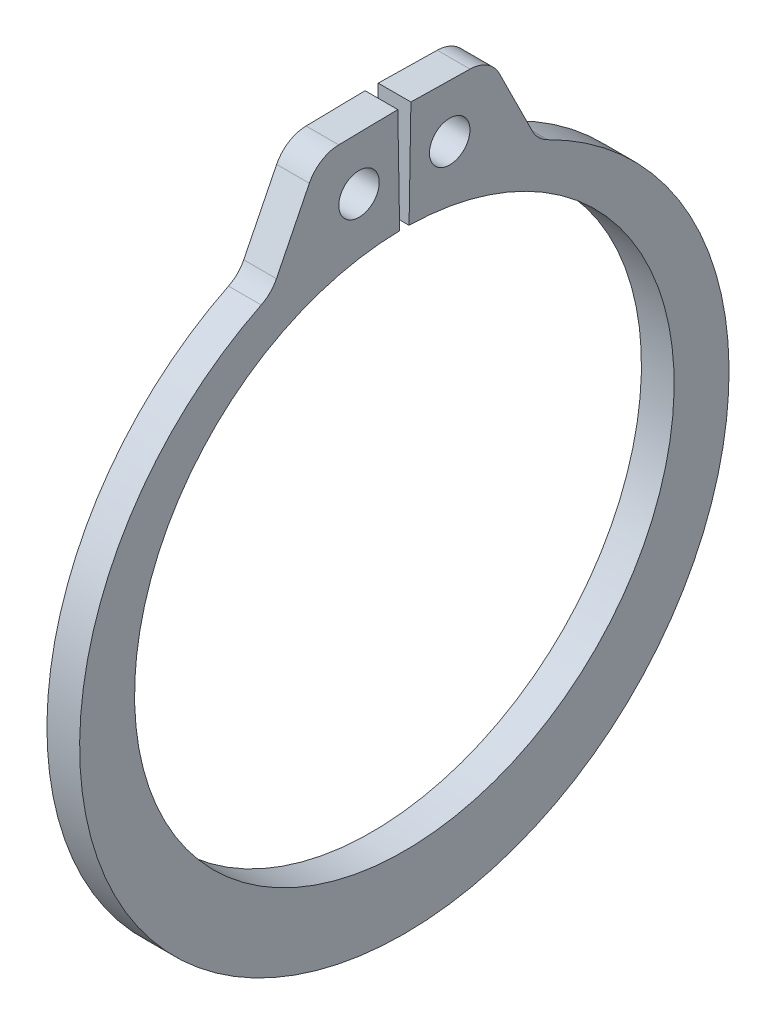
ISO-10303-21;
HEADER;
FILE_DESCRIPTION(('STEP AP214'),'2;1');
FILE_NAME('part.step','',(''),(''),'','','');
FILE_SCHEMA(('AUTOMOTIVE_DESIGN { 1 0 10303 214 1 1 1 1 }'));
ENDSEC;
DATA;
#1=APPLICATION_CONTEXT('core data for automotive mechanical design processes');
#2=APPLICATION_PROTOCOL_DEFINITION('international standard','automotive_design',2000,#1);
#3=PRODUCT_CONTEXT('',#1,'mechanical');
#4=PRODUCT('Part','Part','',(#3));
#5=PRODUCT_RELATED_PRODUCT_CATEGORY('part','',(#4));
#6=PRODUCT_DEFINITION_FORMATION('','',#4);
#7=PRODUCT_DEFINITION_CONTEXT('part definition',#1,'design');
#8=PRODUCT_DEFINITION('design','',#6,#7);
#9=PRODUCT_DEFINITION_SHAPE('','',#8);
#10=(LENGTH_UNIT() NAMED_UNIT(*) SI_UNIT(.MILLI.,.METRE.));
#11=(NAMED_UNIT(*) PLANE_ANGLE_UNIT() SI_UNIT($,.RADIAN.));
#12=(NAMED_UNIT(*) SI_UNIT($,.STERADIAN.) SOLID_ANGLE_UNIT());
#13=UNCERTAINTY_MEASURE_WITH_UNIT(LENGTH_MEASURE(1.E-05),#10,'distance_accuracy_value','');
#14=(GEOMETRIC_REPRESENTATION_CONTEXT(3) GLOBAL_UNCERTAINTY_ASSIGNED_CONTEXT((#13)) GLOBAL_UNIT_ASSIGNED_CONTEXT((#10,
#11,#12)) REPRESENTATION_CONTEXT('',''));
#15=CARTESIAN_POINT('',(0.,0.,0.));
#16=DIRECTION('',(0.,0.,1.));
#17=DIRECTION('',(1.,0.,0.));
#18=AXIS2_PLACEMENT_3D('',#15,#16,#17);
#19=CARTESIAN_POINT('',(0.533399999999989,0.,0.));
#20=DIRECTION('',(1.,0.,0.));
#21=DIRECTION('',(0.,0.,-1.));
#22=AXIS2_PLACEMENT_3D('',#19,#20,#21);
#23=PLANE('',#22);
#24=CARTESIAN_POINT('',(0.533399999999989,10.5040886416162,-1.47894687499924));
#25=DIRECTION('',(-1.,0.,0.));
#26=DIRECTION('',(0.,0.,1.));
#27=AXIS2_PLACEMENT_3D('',#24,#25,#26);
#28=CIRCLE('',#27,0.6604);
#29=CARTESIAN_POINT('',(0.533399999999989,10.5040886416162,-0.818546874999241));
#30=VERTEX_POINT('',#29);
#31=EDGE_CURVE('E109',#30,#30,#28,.T.);
#32=ORIENTED_EDGE('',*,*,#31,.T.);
#33=EDGE_LOOP('',(#32));
#34=FACE_BOUND('',#33,.T.);
#35=CARTESIAN_POINT('',(0.533399999999989,0.,0.));
#36=DIRECTION('',(-1.,0.,0.));
#37=DIRECTION('',(0.,0.,1.));
#38=AXIS2_PLACEMENT_3D('',#35,#36,#37);
#39=CIRCLE('',#38,8.8011);
#40=CARTESIAN_POINT('',(0.533399999999989,8.79975954984092,-0.153600374295177));
#41=VERTEX_POINT('',#40);
#42=CARTESIAN_POINT('',(0.533399999999989,8.79975954984092,0.153600374295175));
#43=VERTEX_POINT('',#42);
#44=EDGE_CURVE('E175',#41,#43,#39,.T.);
#45=ORIENTED_EDGE('',*,*,#44,.T.);
#46=DIRECTION('',(0.,-0.999847695156391,-0.0174524064372834));
#47=VECTOR('',#46,1.);
#48=CARTESIAN_POINT('',(0.533399999999989,8.79975954984091,0.153600374295175));
#49=LINE('',#48,#47);
#50=CARTESIAN_POINT('',(0.533399999999989,12.2536334279892,0.213887967092126));
#51=VERTEX_POINT('',#50);
#52=EDGE_CURVE('E125',#43,#51,#49,.F.);
#53=ORIENTED_EDGE('',*,*,#52,.T.);
#54=DIRECTION('',(0.,0.0174524064372834,-0.999847695156391));
#55=VECTOR('',#54,1.);
#56=CARTESIAN_POINT('',(0.533399999999989,12.2536334279892,0.213887967092126));
#57=LINE('',#56,#55);
#58=CARTESIAN_POINT('',(0.533399999999989,12.21999978275,2.14075821234738));
#59=VERTEX_POINT('',#58);
#60=EDGE_CURVE('E120',#51,#59,#57,.F.);
#61=ORIENTED_EDGE('',*,*,#60,.T.);
#62=CARTESIAN_POINT('',(0.533399999999989,11.1279661301002,2.12169669403658));
#63=DIRECTION('',(-1.,0.,0.));
#64=DIRECTION('',(0.,0.,1.));
#65=AXIS2_PLACEMENT_3D('',#62,#63,#64);
#66=CIRCLE('',#65,1.0922);
#67=CARTESIAN_POINT('',(0.533399999999989,11.6141614114107,3.09971253666458));
#68=VERTEX_POINT('',#67);
#69=EDGE_CURVE('E113',#68,#59,#66,.T.);
#70=ORIENTED_EDGE('',*,*,#69,.F.);
#71=DIRECTION('',(0.,0.895454900776411,-0.445152244378829));
#72=VECTOR('',#71,1.);
#73=CARTESIAN_POINT('',(0.533399999999989,12.2084177333914,2.80429337570331));
#74=LINE('',#73,#72);
#75=CARTESIAN_POINT('',(0.533399999999989,9.45539137797145,4.17288922557434));
#76=VERTEX_POINT('',#75);
#77=EDGE_CURVE('E108',#68,#76,#74,.F.);
#78=ORIENTED_EDGE('',*,*,#77,.T.);
#79=CARTESIAN_POINT('',(0.533399999999989,9.941586659282,5.15090506820234));
#80=DIRECTION('',(-1.,0.,0.));
#81=DIRECTION('',(0.,0.,1.));
#82=AXIS2_PLACEMENT_3D('',#79,#80,#81);
#83=CIRCLE('',#82,1.0922);
#84=CARTESIAN_POINT('',(0.533399999999989,8.96124610534802,4.66941442622431));
#85=VERTEX_POINT('',#84);
#86=EDGE_CURVE('E99',#76,#85,#83,.T.);
#87=ORIENTED_EDGE('',*,*,#86,.T.);
#88=CARTESIAN_POINT('',(0.533399999999989,-0.545929997486656,0.));
#89=DIRECTION('',(-1.,0.,0.));
#90=DIRECTION('',(0.,0.,1.));
#91=AXIS2_PLACEMENT_3D('',#88,#89,#90);
#92=CIRCLE('',#91,10.5919700025133);
#93=CARTESIAN_POINT('',(0.533399999999989,8.96124610534802,-4.66941442622431));
#94=VERTEX_POINT('',#93);
#95=EDGE_CURVE('E182',#94,#85,#92,.T.);
#96=ORIENTED_EDGE('',*,*,#95,.F.);
#97=CARTESIAN_POINT('',(0.533399999999989,9.941586659282,-5.15090506820234));
#98=DIRECTION('',(-1.,0.,0.));
#99=DIRECTION('',(0.,0.,1.));
#100=AXIS2_PLACEMENT_3D('',#97,#98,#99);
#101=CIRCLE('',#100,1.0922);
#102=CARTESIAN_POINT('',(0.533399999999989,9.45539137797145,-4.17288922557434));
#103=VERTEX_POINT('',#102);
#104=EDGE_CURVE('E179',#94,#103,#101,.T.);
#105=ORIENTED_EDGE('',*,*,#104,.T.);
#106=DIRECTION('',(0.,-0.895454900776411,-0.445152244378829));
#107=VECTOR('',#106,1.);
#108=CARTESIAN_POINT('',(0.533399999999989,12.2084177333914,-2.80429337570331));
#109=LINE('',#108,#107);
#110=CARTESIAN_POINT('',(0.533399999999989,11.6141614114107,-3.09971253666458));
#111=VERTEX_POINT('',#110);
#112=EDGE_CURVE('E144',#103,#111,#109,.F.);
#113=ORIENTED_EDGE('',*,*,#112,.T.);
#114=CARTESIAN_POINT('',(0.533399999999989,11.1279661301002,-2.12169669403658));
#115=DIRECTION('',(-1.,0.,0.));
#116=DIRECTION('',(0.,0.,1.));
#117=AXIS2_PLACEMENT_3D('',#114,#115,#116);
#118=CIRCLE('',#117,1.0922);
#119=CARTESIAN_POINT('',(0.533399999999989,12.21999978275,-2.14075821234738));
#120=VERTEX_POINT('',#119);
#121=EDGE_CURVE('E146',#120,#111,#118,.T.);
#122=ORIENTED_EDGE('',*,*,#121,.F.);
#123=DIRECTION('',(0.,-0.0174524064372835,-0.999847695156391));
#124=VECTOR('',#123,1.);
#125=CARTESIAN_POINT('',(0.533399999999989,12.2536334279892,-0.213887967092127));
#126=LINE('',#125,#124);
#127=CARTESIAN_POINT('',(0.533399999999989,12.2536334279892,-0.213887967092128));
#128=VERTEX_POINT('',#127);
#129=EDGE_CURVE('E138',#120,#128,#126,.F.);
#130=ORIENTED_EDGE('',*,*,#129,.T.);
#131=DIRECTION('',(0.,0.999847695156391,-0.0174524064372835));
#132=VECTOR('',#131,1.);
#133=CARTESIAN_POINT('',(0.533399999999989,8.79975954984091,-0.153600374295177));
#134=LINE('',#133,#132);
#135=EDGE_CURVE('E131',#128,#41,#134,.F.);
#136=ORIENTED_EDGE('',*,*,#135,.T.);
#137=EDGE_LOOP('',(#45,#53,#61,#70,#78,#87,#96,#105,#113,#122,#130,#136));
#138=FACE_BOUND('',#137,.T.);
#139=CARTESIAN_POINT('',(0.533399999999989,10.5040886416162,1.47894687499924));
#140=DIRECTION('',(-1.,0.,0.));
#141=DIRECTION('',(0.,0.,1.));
#142=AXIS2_PLACEMENT_3D('',#139,#140,#141);
#143=CIRCLE('',#142,0.6604);
#144=CARTESIAN_POINT('',(0.533399999999989,10.5040886416162,2.13934687499924));
#145=VERTEX_POINT('',#144);
#146=EDGE_CURVE('E21',#145,#145,#143,.T.);
#147=ORIENTED_EDGE('',*,*,#146,.T.);
#148=EDGE_LOOP('',(#147));
#149=FACE_BOUND('',#148,.T.);
#150=ADVANCED_FACE('F18',(#34,#138,#149),#23,.T.);
#151=CARTESIAN_POINT('',(0.533399999999989,10.5040886416162,1.47894687499924));
#152=DIRECTION('',(-1.,0.,0.));
#153=DIRECTION('',(0.,0.,1.));
#154=AXIS2_PLACEMENT_3D('',#151,#152,#153);
#155=CYLINDRICAL_SURFACE('',#154,0.6604);
#156=CARTESIAN_POINT('',(-0.533399999999989,10.5040886416162,1.47894687499924));
#157=DIRECTION('',(-1.,0.,0.));
#158=DIRECTION('',(0.,0.,1.));
#159=AXIS2_PLACEMENT_3D('',#156,#157,#158);
#160=CIRCLE('',#159,0.6604);
#161=CARTESIAN_POINT('',(-0.533399999999989,10.5040886416162,2.13934687499924));
#162=VERTEX_POINT('',#161);
#163=EDGE_CURVE('E169',#162,#162,#160,.T.);
#164=ORIENTED_EDGE('',*,*,#163,.T.);
#165=EDGE_LOOP('',(#164));
#166=FACE_BOUND('',#165,.T.);
#167=ORIENTED_EDGE('',*,*,#146,.F.);
#168=EDGE_LOOP('',(#167));
#169=FACE_BOUND('',#168,.T.);
#170=ADVANCED_FACE('F362',(#166,#169),#155,.F.);
#171=CARTESIAN_POINT('',(0.533399999999989,9.941586659282,5.15090506820234));
#172=DIRECTION('',(-1.,0.,0.));
#173=DIRECTION('',(0.,0.,1.));
#174=AXIS2_PLACEMENT_3D('',#171,#172,#173);
#175=CYLINDRICAL_SURFACE('',#174,1.0922);
#176=DIRECTION('',(1.,0.,0.));
#177=VECTOR('',#176,1.);
#178=CARTESIAN_POINT('',(0.533399999999989,9.45539137797145,4.17288922557434));
#179=LINE('',#178,#177);
#180=CARTESIAN_POINT('',(-0.533399999999989,9.45539137797145,4.17288922557434));
#181=VERTEX_POINT('',#180);
#182=EDGE_CURVE('E103',#76,#181,#179,.F.);
#183=ORIENTED_EDGE('',*,*,#182,.T.);
#184=CARTESIAN_POINT('',(-0.533399999999989,9.941586659282,5.15090506820234));
#185=DIRECTION('',(-1.,0.,0.));
#186=DIRECTION('',(0.,0.,1.));
#187=AXIS2_PLACEMENT_3D('',#184,#185,#186);
#188=CIRCLE('',#187,1.0922);
#189=CARTESIAN_POINT('',(-0.533399999999989,8.96124610534802,4.66941442622431));
#190=VERTEX_POINT('',#189);
#191=EDGE_CURVE('E167',#181,#190,#188,.T.);
#192=ORIENTED_EDGE('',*,*,#191,.T.);
#193=DIRECTION('',(-1.,0.,0.));
#194=VECTOR('',#193,1.);
#195=CARTESIAN_POINT('',(0.533399999999989,8.96124610534802,4.66941442622431));
#196=LINE('',#195,#194);
#197=EDGE_CURVE('E104',#85,#190,#196,.T.);
#198=ORIENTED_EDGE('',*,*,#197,.F.);
#199=ORIENTED_EDGE('',*,*,#86,.F.);
#200=EDGE_LOOP('',(#183,#192,#198,#199));
#201=FACE_BOUND('',#200,.T.);
#202=ADVANCED_FACE('F101',(#201),#175,.F.);
#203=CARTESIAN_POINT('',(0.533399999999989,-0.545929997486656,0.));
#204=DIRECTION('',(-1.,0.,0.));
#205=DIRECTION('',(0.,0.,1.));
#206=AXIS2_PLACEMENT_3D('',#203,#204,#205);
#207=CYLINDRICAL_SURFACE('',#206,10.5919700025133);
#208=CARTESIAN_POINT('',(-0.533399999999989,-0.545929997486656,0.));
#209=DIRECTION('',(-1.,0.,0.));
#210=DIRECTION('',(0.,0.,1.));
#211=AXIS2_PLACEMENT_3D('',#208,#209,#210);
#212=CIRCLE('',#211,10.5919700025133);
#213=CARTESIAN_POINT('',(-0.533399999999989,8.96124610534802,-4.66941442622431));
#214=VERTEX_POINT('',#213);
#215=EDGE_CURVE('E165',#190,#214,#212,.F.);
#216=ORIENTED_EDGE('',*,*,#215,.T.);
#217=DIRECTION('',(-1.,0.,0.));
#218=VECTOR('',#217,1.);
#219=CARTESIAN_POINT('',(0.533399999999989,8.96124610534802,-4.66941442622431));
#220=LINE('',#219,#218);
#221=EDGE_CURVE('E181',#214,#94,#220,.F.);
#222=ORIENTED_EDGE('',*,*,#221,.T.);
#223=ORIENTED_EDGE('',*,*,#95,.T.);
#224=ORIENTED_EDGE('',*,*,#197,.T.);
#225=EDGE_LOOP('',(#216,#222,#223,#224));
#226=FACE_BOUND('',#225,.T.);
#227=ADVANCED_FACE('F187',(#226),#207,.T.);
#228=CARTESIAN_POINT('',(0.533399999999989,9.941586659282,-5.15090506820234));
#229=DIRECTION('',(-1.,0.,0.));
#230=DIRECTION('',(0.,0.,1.));
#231=AXIS2_PLACEMENT_3D('',#228,#229,#230);
#232=CYLINDRICAL_SURFACE('',#231,1.0922);
#233=ORIENTED_EDGE('',*,*,#221,.F.);
#234=CARTESIAN_POINT('',(-0.533399999999989,9.941586659282,-5.15090506820234));
#235=DIRECTION('',(-1.,0.,0.));
#236=DIRECTION('',(0.,0.,1.));
#237=AXIS2_PLACEMENT_3D('',#234,#235,#236);
#238=CIRCLE('',#237,1.0922);
#239=CARTESIAN_POINT('',(-0.533399999999989,9.45539137797145,-4.17288922557434));
#240=VERTEX_POINT('',#239);
#241=EDGE_CURVE('E162',#214,#240,#238,.T.);
#242=ORIENTED_EDGE('',*,*,#241,.T.);
#243=DIRECTION('',(1.,0.,0.));
#244=VECTOR('',#243,1.);
#245=CARTESIAN_POINT('',(0.533399999999989,9.45539137797145,-4.17288922557434));
#246=LINE('',#245,#244);
#247=EDGE_CURVE('E147',#240,#103,#246,.T.);
#248=ORIENTED_EDGE('',*,*,#247,.T.);
#249=ORIENTED_EDGE('',*,*,#104,.F.);
#250=EDGE_LOOP('',(#233,#242,#248,#249));
#251=FACE_BOUND('',#250,.T.);
#252=ADVANCED_FACE('F199',(#251),#232,.F.);
#253=CARTESIAN_POINT('',(0.533399999999989,12.2084177333914,-2.80429337570331));
#254=DIRECTION('',(0.,-0.445152244378829,0.895454900776411));
#255=DIRECTION('',(0.,-0.895454900776411,-0.445152244378829));
#256=AXIS2_PLACEMENT_3D('',#253,#254,#255);
#257=PLANE('',#256);
#258=ORIENTED_EDGE('',*,*,#247,.F.);
#259=DIRECTION('',(0.,0.89545490077641,0.445152244378829));
#260=VECTOR('',#259,1.);
#261=CARTESIAN_POINT('',(-0.533399999999989,9.45539137797145,-4.17288922557434));
#262=LINE('',#261,#260);
#263=CARTESIAN_POINT('',(-0.533399999999989,11.6141614114107,-3.09971253666458));
#264=VERTEX_POINT('',#263);
#265=EDGE_CURVE('E161',#240,#264,#262,.T.);
#266=ORIENTED_EDGE('',*,*,#265,.T.);
#267=DIRECTION('',(-1.,0.,0.));
#268=VECTOR('',#267,1.);
#269=CARTESIAN_POINT('',(0.533399999999989,11.6141614114107,-3.09971253666458));
#270=LINE('',#269,#268);
#271=EDGE_CURVE('E178',#111,#264,#270,.T.);
#272=ORIENTED_EDGE('',*,*,#271,.F.);
#273=ORIENTED_EDGE('',*,*,#112,.F.);
#274=EDGE_LOOP('',(#258,#266,#272,#273));
#275=FACE_BOUND('',#274,.T.);
#276=ADVANCED_FACE('F204',(#275),#257,.F.);
#277=CARTESIAN_POINT('',(0.533399999999989,11.1279661301002,-2.12169669403658));
#278=DIRECTION('',(-1.,0.,0.));
#279=DIRECTION('',(0.,0.,1.));
#280=AXIS2_PLACEMENT_3D('',#277,#278,#279);
#281=CYLINDRICAL_SURFACE('',#280,1.0922);
#282=CARTESIAN_POINT('',(-0.533399999999989,11.1279661301002,-2.12169669403658));
#283=DIRECTION('',(-1.,0.,0.));
#284=DIRECTION('',(0.,0.,1.));
#285=AXIS2_PLACEMENT_3D('',#282,#283,#284);
#286=CIRCLE('',#285,1.0922);
#287=CARTESIAN_POINT('',(-0.533399999999989,12.21999978275,-2.14075821234738));
#288=VERTEX_POINT('',#287);
#289=EDGE_CURVE('E157',#264,#288,#286,.F.);
#290=ORIENTED_EDGE('',*,*,#289,.T.);
#291=DIRECTION('',(1.,0.,0.));
#292=VECTOR('',#291,1.);
#293=CARTESIAN_POINT('',(0.533399999999989,12.21999978275,-2.14075821234738));
#294=LINE('',#293,#292);
#295=EDGE_CURVE('E141',#288,#120,#294,.T.);
#296=ORIENTED_EDGE('',*,*,#295,.T.);
#297=ORIENTED_EDGE('',*,*,#121,.T.);
#298=ORIENTED_EDGE('',*,*,#271,.T.);
#299=EDGE_LOOP('',(#290,#296,#297,#298));
#300=FACE_BOUND('',#299,.T.);
#301=ADVANCED_FACE('F267',(#300),#281,.T.);
#302=CARTESIAN_POINT('',(0.533399999999989,12.2536334279892,-0.213887967092127));
#303=DIRECTION('',(0.,-0.999847695156391,0.0174524064372835));
#304=DIRECTION('',(0.,-0.0174524064372835,-0.999847695156391));
#305=AXIS2_PLACEMENT_3D('',#302,#303,#304);
#306=PLANE('',#305);
#307=ORIENTED_EDGE('',*,*,#295,.F.);
#308=DIRECTION('',(0.,0.0174524064372837,0.999847695156391));
#309=VECTOR('',#308,1.);
#310=CARTESIAN_POINT('',(-0.533399999999989,12.21999978275,-2.14075821234738));
#311=LINE('',#310,#309);
#312=CARTESIAN_POINT('',(-0.533399999999989,12.2536334279892,-0.213887967092128));
#313=VERTEX_POINT('',#312);
#314=EDGE_CURVE('E160',#288,#313,#311,.T.);
#315=ORIENTED_EDGE('',*,*,#314,.T.);
#316=DIRECTION('',(1.,0.,0.));
#317=VECTOR('',#316,1.);
#318=CARTESIAN_POINT('',(0.533399999999989,12.2536334279892,-0.213887967092129));
#319=LINE('',#318,#317);
#320=EDGE_CURVE('E135',#313,#128,#319,.T.);
#321=ORIENTED_EDGE('',*,*,#320,.T.);
#322=ORIENTED_EDGE('',*,*,#129,.F.);
#323=EDGE_LOOP('',(#307,#315,#321,#322));
#324=FACE_BOUND('',#323,.T.);
#325=ADVANCED_FACE('F265',(#324),#306,.F.);
#326=CARTESIAN_POINT('',(0.533399999999989,8.79975954984091,-0.153600374295177));
#327=DIRECTION('',(0.,-0.0174524064372835,-0.999847695156391));
#328=DIRECTION('',(0.,0.999847695156391,-0.0174524064372835));
#329=AXIS2_PLACEMENT_3D('',#326,#327,#328);
#330=PLANE('',#329);
#331=DIRECTION('',(-1.,0.,0.));
#332=VECTOR('',#331,1.);
#333=CARTESIAN_POINT('',(0.533399999999989,8.79975954984092,-0.153600374295178));
#334=LINE('',#333,#332);
#335=CARTESIAN_POINT('',(-0.533399999999989,8.79975954984092,-0.153600374295177));
#336=VERTEX_POINT('',#335);
#337=EDGE_CURVE('E134',#336,#41,#334,.F.);
#338=ORIENTED_EDGE('',*,*,#337,.T.);
#339=ORIENTED_EDGE('',*,*,#135,.F.);
#340=ORIENTED_EDGE('',*,*,#320,.F.);
#341=DIRECTION('',(0.,-0.999847695156391,0.017452406437283));
#342=VECTOR('',#341,1.);
#343=CARTESIAN_POINT('',(-0.533399999999989,12.2536334279892,-0.213887967092127));
#344=LINE('',#343,#342);
#345=EDGE_CURVE('E156',#313,#336,#344,.T.);
#346=ORIENTED_EDGE('',*,*,#345,.T.);
#347=EDGE_LOOP('',(#338,#339,#340,#346));
#348=FACE_BOUND('',#347,.T.);
#349=ADVANCED_FACE('F260',(#348),#330,.F.);
#350=CARTESIAN_POINT('',(0.533399999999989,0.,0.));
#351=DIRECTION('',(-1.,0.,0.));
#352=DIRECTION('',(0.,0.,1.));
#353=AXIS2_PLACEMENT_3D('',#350,#351,#352);
#354=CYLINDRICAL_SURFACE('',#353,8.8011);
#355=ORIENTED_EDGE('',*,*,#44,.F.);
#356=ORIENTED_EDGE('',*,*,#337,.F.);
#357=CARTESIAN_POINT('',(-0.533399999999989,0.,0.));
#358=DIRECTION('',(-1.,0.,0.));
#359=DIRECTION('',(0.,0.,1.));
#360=AXIS2_PLACEMENT_3D('',#357,#358,#359);
#361=CIRCLE('',#360,8.8011);
#362=CARTESIAN_POINT('',(-0.533399999999989,8.79975954984092,0.153600374295175));
#363=VERTEX_POINT('',#362);
#364=EDGE_CURVE('E153',#336,#363,#361,.T.);
#365=ORIENTED_EDGE('',*,*,#364,.T.);
#366=DIRECTION('',(1.,0.,0.));
#367=VECTOR('',#366,1.);
#368=CARTESIAN_POINT('',(0.533399999999989,8.79975954984091,0.153600374295175));
#369=LINE('',#368,#367);
#370=EDGE_CURVE('E128',#363,#43,#369,.T.);
#371=ORIENTED_EDGE('',*,*,#370,.T.);
#372=EDGE_LOOP('',(#355,#356,#365,#371));
#373=FACE_BOUND('',#372,.T.);
#374=ADVANCED_FACE('F255',(#373),#354,.F.);
#375=CARTESIAN_POINT('',(0.533399999999989,8.79975954984091,0.153600374295175));
#376=DIRECTION('',(0.,-0.0174524064372834,0.999847695156391));
#377=DIRECTION('',(0.,-0.999847695156391,-0.0174524064372834));
#378=AXIS2_PLACEMENT_3D('',#375,#376,#377);
#379=PLANE('',#378);
#380=DIRECTION('',(1.,0.,0.));
#381=VECTOR('',#380,1.);
#382=CARTESIAN_POINT('',(0.533399999999989,12.2536334279892,0.213887967092126));
#383=LINE('',#382,#381);
#384=CARTESIAN_POINT('',(-0.533399999999989,12.2536334279892,0.213887967092126));
#385=VERTEX_POINT('',#384);
#386=EDGE_CURVE('E122',#385,#51,#383,.T.);
#387=ORIENTED_EDGE('',*,*,#386,.T.);
#388=ORIENTED_EDGE('',*,*,#52,.F.);
#389=ORIENTED_EDGE('',*,*,#370,.F.);
#390=DIRECTION('',(0.,0.999847695156391,0.0174524064372833));
#391=VECTOR('',#390,1.);
#392=CARTESIAN_POINT('',(-0.533399999999989,8.79975954984091,0.153600374295175));
#393=LINE('',#392,#391);
#394=EDGE_CURVE('E155',#363,#385,#393,.T.);
#395=ORIENTED_EDGE('',*,*,#394,.T.);
#396=EDGE_LOOP('',(#387,#388,#389,#395));
#397=FACE_BOUND('',#396,.T.);
#398=ADVANCED_FACE('F252',(#397),#379,.F.);
#399=CARTESIAN_POINT('',(0.533399999999989,12.2536334279892,0.213887967092126));
#400=DIRECTION('',(0.,-0.999847695156391,-0.0174524064372834));
#401=DIRECTION('',(0.,0.0174524064372834,-0.999847695156391));
#402=AXIS2_PLACEMENT_3D('',#399,#400,#401);
#403=PLANE('',#402);
#404=DIRECTION('',(-1.,0.,0.));
#405=VECTOR('',#404,1.);
#406=CARTESIAN_POINT('',(0.533399999999989,12.21999978275,2.14075821234738));
#407=LINE('',#406,#405);
#408=CARTESIAN_POINT('',(-0.533399999999989,12.21999978275,2.14075821234738));
#409=VERTEX_POINT('',#408);
#410=EDGE_CURVE('E115',#59,#409,#407,.T.);
#411=ORIENTED_EDGE('',*,*,#410,.F.);
#412=ORIENTED_EDGE('',*,*,#60,.F.);
#413=ORIENTED_EDGE('',*,*,#386,.F.);
#414=DIRECTION('',(0.,-0.0174524064372828,0.999847695156391));
#415=VECTOR('',#414,1.);
#416=CARTESIAN_POINT('',(-0.533399999999989,12.2536334279892,0.213887967092126));
#417=LINE('',#416,#415);
#418=EDGE_CURVE('E152',#385,#409,#417,.T.);
#419=ORIENTED_EDGE('',*,*,#418,.T.);
#420=EDGE_LOOP('',(#411,#412,#413,#419));
#421=FACE_BOUND('',#420,.T.);
#422=ADVANCED_FACE('F245',(#421),#403,.F.);
#423=CARTESIAN_POINT('',(0.533399999999989,11.1279661301002,2.12169669403658));
#424=DIRECTION('',(-1.,0.,0.));
#425=DIRECTION('',(0.,0.,1.));
#426=AXIS2_PLACEMENT_3D('',#423,#424,#425);
#427=CYLINDRICAL_SURFACE('',#426,1.0922);
#428=CARTESIAN_POINT('',(-0.533399999999989,11.1279661301002,2.12169669403658));
#429=DIRECTION('',(-1.,0.,0.));
#430=DIRECTION('',(0.,0.,1.));
#431=AXIS2_PLACEMENT_3D('',#428,#429,#430);
#432=CIRCLE('',#431,1.0922);
#433=CARTESIAN_POINT('',(-0.533399999999989,11.6141614114107,3.09971253666458));
#434=VERTEX_POINT('',#433);
#435=EDGE_CURVE('E149',#409,#434,#432,.F.);
#436=ORIENTED_EDGE('',*,*,#435,.T.);
#437=DIRECTION('',(1.,0.,0.));
#438=VECTOR('',#437,1.);
#439=CARTESIAN_POINT('',(0.533399999999989,11.6141614114107,3.09971253666458));
#440=LINE('',#439,#438);
#441=EDGE_CURVE('E36',#434,#68,#440,.T.);
#442=ORIENTED_EDGE('',*,*,#441,.T.);
#443=ORIENTED_EDGE('',*,*,#69,.T.);
#444=ORIENTED_EDGE('',*,*,#410,.T.);
#445=EDGE_LOOP('',(#436,#442,#443,#444));
#446=FACE_BOUND('',#445,.T.);
#447=ADVANCED_FACE('F290',(#446),#427,.T.);
#448=CARTESIAN_POINT('',(0.533399999999989,12.2084177333914,2.80429337570331));
#449=DIRECTION('',(0.,-0.445152244378829,-0.895454900776411));
#450=DIRECTION('',(0.,0.895454900776411,-0.445152244378829));
#451=AXIS2_PLACEMENT_3D('',#448,#449,#450);
#452=PLANE('',#451);
#453=ORIENTED_EDGE('',*,*,#182,.F.);
#454=ORIENTED_EDGE('',*,*,#77,.F.);
#455=ORIENTED_EDGE('',*,*,#441,.F.);
#456=DIRECTION('',(0.,-0.895454900776411,0.445152244378828));
#457=VECTOR('',#456,1.);
#458=CARTESIAN_POINT('',(-0.533399999999989,11.6141614114107,3.09971253666458));
#459=LINE('',#458,#457);
#460=EDGE_CURVE('E27',#434,#181,#459,.T.);
#461=ORIENTED_EDGE('',*,*,#460,.T.);
#462=EDGE_LOOP('',(#453,#454,#455,#461));
#463=FACE_BOUND('',#462,.T.);
#464=ADVANCED_FACE('F107',(#463),#452,.F.);
#465=CARTESIAN_POINT('',(0.533399999999989,10.5040886416162,-1.47894687499924));
#466=DIRECTION('',(-1.,0.,0.));
#467=DIRECTION('',(0.,0.,1.));
#468=AXIS2_PLACEMENT_3D('',#465,#466,#467);
#469=CYLINDRICAL_SURFACE('',#468,0.6604);
#470=CARTESIAN_POINT('',(-0.533399999999989,10.5040886416162,-1.47894687499924));
#471=DIRECTION('',(-1.,0.,0.));
#472=DIRECTION('',(0.,0.,1.));
#473=AXIS2_PLACEMENT_3D('',#470,#471,#472);
#474=CIRCLE('',#473,0.6604);
#475=CARTESIAN_POINT('',(-0.533399999999989,10.5040886416162,-0.818546874999241));
#476=VERTEX_POINT('',#475);
#477=EDGE_CURVE('E11',#476,#476,#474,.T.);
#478=ORIENTED_EDGE('',*,*,#477,.T.);
#479=EDGE_LOOP('',(#478));
#480=FACE_BOUND('',#479,.T.);
#481=ORIENTED_EDGE('',*,*,#31,.F.);
#482=EDGE_LOOP('',(#481));
#483=FACE_BOUND('',#482,.T.);
#484=ADVANCED_FACE('F278',(#480,#483),#469,.F.);
#485=CARTESIAN_POINT('',(-0.533399999999989,0.,0.));
#486=DIRECTION('',(1.,0.,0.));
#487=DIRECTION('',(0.,0.,-1.));
#488=AXIS2_PLACEMENT_3D('',#485,#486,#487);
#489=PLANE('',#488);
#490=ORIENTED_EDGE('',*,*,#477,.F.);
#491=EDGE_LOOP('',(#490));
#492=FACE_BOUND('',#491,.T.);
#493=ORIENTED_EDGE('',*,*,#435,.F.);
#494=ORIENTED_EDGE('',*,*,#418,.F.);
#495=ORIENTED_EDGE('',*,*,#394,.F.);
#496=ORIENTED_EDGE('',*,*,#364,.F.);
#497=ORIENTED_EDGE('',*,*,#345,.F.);
#498=ORIENTED_EDGE('',*,*,#314,.F.);
#499=ORIENTED_EDGE('',*,*,#289,.F.);
#500=ORIENTED_EDGE('',*,*,#265,.F.);
#501=ORIENTED_EDGE('',*,*,#241,.F.);
#502=ORIENTED_EDGE('',*,*,#215,.F.);
#503=ORIENTED_EDGE('',*,*,#191,.F.);
#504=ORIENTED_EDGE('',*,*,#460,.F.);
#505=EDGE_LOOP('',(#493,#494,#495,#496,#497,#498,#499,#500,#501,#502,#503,#504));
#506=FACE_BOUND('',#505,.T.);
#507=ORIENTED_EDGE('',*,*,#163,.F.);
#508=EDGE_LOOP('',(#507));
#509=FACE_BOUND('',#508,.T.);
#510=ADVANCED_FACE('F192',(#492,#506,#509),#489,.F.);
#511=CLOSED_SHELL('',(#150,#170,#202,#227,#252,#276,#301,#325,#349,#374,#398,#422,#447,#464,
#484,#510));
#512=MANIFOLD_SOLID_BREP('B1',#511);
#513=ADVANCED_BREP_SHAPE_REPRESENTATION('',(#18,#512),#14);
#514=SHAPE_DEFINITION_REPRESENTATION(#9,#513);
ENDSEC;
END-ISO-10303-21;
